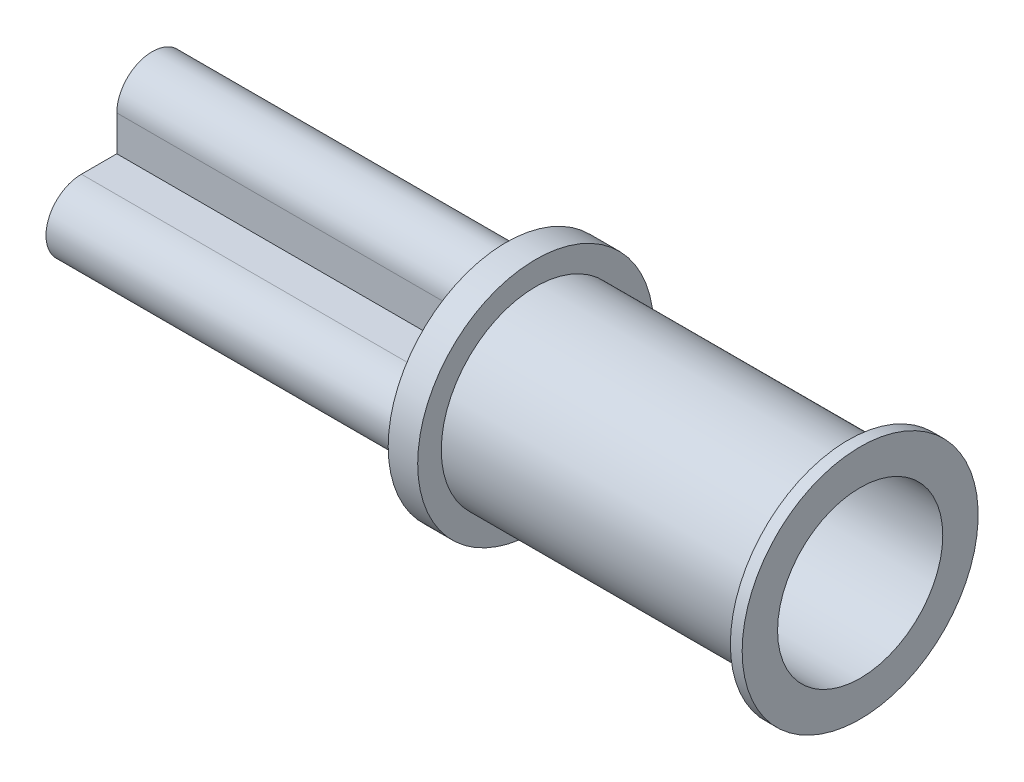
ISO-10303-21;
HEADER;
FILE_DESCRIPTION(('STEP AP214'),'2;1');
FILE_NAME('part.step','',(''),(''),'','','');
FILE_SCHEMA(('AUTOMOTIVE_DESIGN { 1 0 10303 214 1 1 1 1 }'));
ENDSEC;
DATA;
#1=APPLICATION_CONTEXT('core data for automotive mechanical design processes');
#2=APPLICATION_PROTOCOL_DEFINITION('international standard','automotive_design',2000,#1);
#3=PRODUCT_CONTEXT('',#1,'mechanical');
#4=PRODUCT('Part','Part','',(#3));
#5=PRODUCT_RELATED_PRODUCT_CATEGORY('part','',(#4));
#6=PRODUCT_DEFINITION_FORMATION('','',#4);
#7=PRODUCT_DEFINITION_CONTEXT('part definition',#1,'design');
#8=PRODUCT_DEFINITION('design','',#6,#7);
#9=PRODUCT_DEFINITION_SHAPE('','',#8);
#10=(LENGTH_UNIT() NAMED_UNIT(*) SI_UNIT(.MILLI.,.METRE.));
#11=(NAMED_UNIT(*) PLANE_ANGLE_UNIT() SI_UNIT($,.RADIAN.));
#12=(NAMED_UNIT(*) SI_UNIT($,.STERADIAN.) SOLID_ANGLE_UNIT());
#13=UNCERTAINTY_MEASURE_WITH_UNIT(LENGTH_MEASURE(1.E-05),#10,'distance_accuracy_value','');
#14=(GEOMETRIC_REPRESENTATION_CONTEXT(3) GLOBAL_UNCERTAINTY_ASSIGNED_CONTEXT((#13)) GLOBAL_UNIT_ASSIGNED_CONTEXT((#10,
#11,#12)) REPRESENTATION_CONTEXT('',''));
#15=CARTESIAN_POINT('',(0.,0.,0.));
#16=DIRECTION('',(0.,0.,1.));
#17=DIRECTION('',(1.,0.,0.));
#18=AXIS2_PLACEMENT_3D('',#15,#16,#17);
#19=CARTESIAN_POINT('',(0.635,0.,0.));
#20=DIRECTION('',(-1.,0.,0.));
#21=DIRECTION('',(0.,0.,1.));
#22=AXIS2_PLACEMENT_3D('',#19,#20,#21);
#23=PLANE('',#22);
#24=CARTESIAN_POINT('',(0.635,0.,0.));
#25=DIRECTION('',(-1.,0.,0.));
#26=DIRECTION('',(0.,0.,1.));
#27=AXIS2_PLACEMENT_3D('',#24,#25,#26);
#28=CIRCLE('',#27,1.778);
#29=CARTESIAN_POINT('',(0.635,0.,1.778));
#30=VERTEX_POINT('',#29);
#31=EDGE_CURVE('E11',#30,#30,#28,.T.);
#32=ORIENTED_EDGE('',*,*,#31,.F.);
#33=EDGE_LOOP('',(#32));
#34=FACE_BOUND('',#33,.T.);
#35=ADVANCED_FACE('F32',(#34),#23,.F.);
#36=CARTESIAN_POINT('',(0.,0.,0.));
#37=DIRECTION('',(-1.,0.,0.));
#38=DIRECTION('',(0.,0.,1.));
#39=AXIS2_PLACEMENT_3D('',#36,#37,#38);
#40=CYLINDRICAL_SURFACE('',#39,1.778);
#41=CARTESIAN_POINT('',(7.62,0.,0.));
#42=DIRECTION('',(-1.,0.,0.));
#43=DIRECTION('',(0.,0.,1.));
#44=AXIS2_PLACEMENT_3D('',#41,#42,#43);
#45=CIRCLE('',#44,1.778);
#46=CARTESIAN_POINT('',(7.62,0.,1.778));
#47=VERTEX_POINT('',#46);
#48=EDGE_CURVE('E39',#47,#47,#45,.T.);
#49=ORIENTED_EDGE('',*,*,#48,.F.);
#50=EDGE_LOOP('',(#49));
#51=FACE_BOUND('',#50,.T.);
#52=ORIENTED_EDGE('',*,*,#31,.T.);
#53=EDGE_LOOP('',(#52));
#54=FACE_BOUND('',#53,.T.);
#55=ADVANCED_FACE('F231',(#51,#54),#40,.F.);
#56=CARTESIAN_POINT('',(7.62,2.54,0.));
#57=DIRECTION('',(-1.,0.,0.));
#58=DIRECTION('',(0.,0.,1.));
#59=AXIS2_PLACEMENT_3D('',#56,#57,#58);
#60=PLANE('',#59);
#61=CARTESIAN_POINT('',(7.62,0.,0.));
#62=DIRECTION('',(-1.,0.,0.));
#63=DIRECTION('',(0.,0.,1.));
#64=AXIS2_PLACEMENT_3D('',#61,#62,#63);
#65=CIRCLE('',#64,2.54);
#66=CARTESIAN_POINT('',(7.62,0.,2.54));
#67=VERTEX_POINT('',#66);
#68=EDGE_CURVE('E224',#67,#67,#65,.T.);
#69=ORIENTED_EDGE('',*,*,#68,.F.);
#70=EDGE_LOOP('',(#69));
#71=FACE_BOUND('',#70,.T.);
#72=ORIENTED_EDGE('',*,*,#48,.T.);
#73=EDGE_LOOP('',(#72));
#74=FACE_BOUND('',#73,.T.);
#75=ADVANCED_FACE('F229',(#71,#74),#60,.F.);
#76=CARTESIAN_POINT('',(0.,0.,0.));
#77=DIRECTION('',(-1.,0.,0.));
#78=DIRECTION('',(0.,0.,1.));
#79=AXIS2_PLACEMENT_3D('',#76,#77,#78);
#80=CYLINDRICAL_SURFACE('',#79,2.54);
#81=CARTESIAN_POINT('',(7.366,0.,0.));
#82=DIRECTION('',(-1.,0.,0.));
#83=DIRECTION('',(0.,0.,1.));
#84=AXIS2_PLACEMENT_3D('',#81,#82,#83);
#85=CIRCLE('',#84,2.54);
#86=CARTESIAN_POINT('',(7.366,0.,2.54));
#87=VERTEX_POINT('',#86);
#88=EDGE_CURVE('E221',#87,#87,#85,.T.);
#89=ORIENTED_EDGE('',*,*,#88,.F.);
#90=EDGE_LOOP('',(#89));
#91=FACE_BOUND('',#90,.T.);
#92=ORIENTED_EDGE('',*,*,#68,.T.);
#93=EDGE_LOOP('',(#92));
#94=FACE_BOUND('',#93,.T.);
#95=ADVANCED_FACE('F249',(#91,#94),#80,.T.);
#96=CARTESIAN_POINT('',(7.366,2.032,0.));
#97=DIRECTION('',(1.,0.,0.));
#98=DIRECTION('',(0.,0.,-1.));
#99=AXIS2_PLACEMENT_3D('',#96,#97,#98);
#100=PLANE('',#99);
#101=CARTESIAN_POINT('',(7.366,0.,0.));
#102=DIRECTION('',(-1.,0.,0.));
#103=DIRECTION('',(0.,0.,1.));
#104=AXIS2_PLACEMENT_3D('',#101,#102,#103);
#105=CIRCLE('',#104,2.032);
#106=CARTESIAN_POINT('',(7.366,0.,2.032));
#107=VERTEX_POINT('',#106);
#108=EDGE_CURVE('E218',#107,#107,#105,.T.);
#109=ORIENTED_EDGE('',*,*,#108,.F.);
#110=EDGE_LOOP('',(#109));
#111=FACE_BOUND('',#110,.T.);
#112=ORIENTED_EDGE('',*,*,#88,.T.);
#113=EDGE_LOOP('',(#112));
#114=FACE_BOUND('',#113,.T.);
#115=ADVANCED_FACE('F257',(#111,#114),#100,.F.);
#116=CARTESIAN_POINT('',(0.,0.,0.));
#117=DIRECTION('',(-1.,0.,0.));
#118=DIRECTION('',(0.,0.,1.));
#119=AXIS2_PLACEMENT_3D('',#116,#117,#118);
#120=CYLINDRICAL_SURFACE('',#119,2.032);
#121=CARTESIAN_POINT('',(0.635,0.,0.));
#122=DIRECTION('',(-1.,0.,0.));
#123=DIRECTION('',(0.,0.,1.));
#124=AXIS2_PLACEMENT_3D('',#121,#122,#123);
#125=CIRCLE('',#124,2.032);
#126=CARTESIAN_POINT('',(0.635,0.,2.032));
#127=VERTEX_POINT('',#126);
#128=EDGE_CURVE('E215',#127,#127,#125,.T.);
#129=ORIENTED_EDGE('',*,*,#128,.F.);
#130=EDGE_LOOP('',(#129));
#131=FACE_BOUND('',#130,.T.);
#132=ORIENTED_EDGE('',*,*,#108,.T.);
#133=EDGE_LOOP('',(#132));
#134=FACE_BOUND('',#133,.T.);
#135=ADVANCED_FACE('F265',(#131,#134),#120,.T.);
#136=CARTESIAN_POINT('',(0.635,2.54,0.));
#137=DIRECTION('',(-1.,0.,0.));
#138=DIRECTION('',(0.,0.,1.));
#139=AXIS2_PLACEMENT_3D('',#136,#137,#138);
#140=PLANE('',#139);
#141=CARTESIAN_POINT('',(0.635,0.,0.));
#142=DIRECTION('',(-1.,0.,0.));
#143=DIRECTION('',(0.,0.,1.));
#144=AXIS2_PLACEMENT_3D('',#141,#142,#143);
#145=CIRCLE('',#144,2.54);
#146=CARTESIAN_POINT('',(0.635,0.,2.54));
#147=VERTEX_POINT('',#146);
#148=EDGE_CURVE('E212',#147,#147,#145,.T.);
#149=ORIENTED_EDGE('',*,*,#148,.F.);
#150=EDGE_LOOP('',(#149));
#151=FACE_BOUND('',#150,.T.);
#152=ORIENTED_EDGE('',*,*,#128,.T.);
#153=EDGE_LOOP('',(#152));
#154=FACE_BOUND('',#153,.T.);
#155=ADVANCED_FACE('F273',(#151,#154),#140,.F.);
#156=CARTESIAN_POINT('',(0.,0.,0.));
#157=DIRECTION('',(-1.,0.,0.));
#158=DIRECTION('',(0.,0.,1.));
#159=AXIS2_PLACEMENT_3D('',#156,#157,#158);
#160=CYLINDRICAL_SURFACE('',#159,2.54);
#161=CARTESIAN_POINT('',(0.,0.,0.));
#162=DIRECTION('',(-1.,0.,0.));
#163=DIRECTION('',(0.,0.,1.));
#164=AXIS2_PLACEMENT_3D('',#161,#162,#163);
#165=CIRCLE('',#164,2.54);
#166=CARTESIAN_POINT('',(0.,0.,2.54));
#167=VERTEX_POINT('',#166);
#168=EDGE_CURVE('E192',#167,#167,#165,.T.);
#169=ORIENTED_EDGE('',*,*,#168,.F.);
#170=EDGE_LOOP('',(#169));
#171=FACE_BOUND('',#170,.T.);
#172=ORIENTED_EDGE('',*,*,#148,.T.);
#173=EDGE_LOOP('',(#172));
#174=FACE_BOUND('',#173,.T.);
#175=ADVANCED_FACE('F281',(#171,#174),#160,.T.);
#176=CARTESIAN_POINT('',(0.,1.778,0.));
#177=DIRECTION('',(1.,0.,0.));
#178=DIRECTION('',(0.,0.,-1.));
#179=AXIS2_PLACEMENT_3D('',#176,#177,#178);
#180=PLANE('',#179);
#181=DIRECTION('',(0.,0.,1.));
#182=VECTOR('',#181,1.);
#183=CARTESIAN_POINT('',(0.,0.762000000000001,1.524));
#184=LINE('',#183,#182);
#185=CARTESIAN_POINT('',(0.,0.762000000000001,0.761999999999998));
#186=VERTEX_POINT('',#185);
#187=CARTESIAN_POINT('',(0.,0.762000000000001,1.524));
#188=VERTEX_POINT('',#187);
#189=EDGE_CURVE('E187',#186,#188,#184,.T.);
#190=ORIENTED_EDGE('',*,*,#189,.T.);
#191=CARTESIAN_POINT('',(0.,0.,1.524));
#192=DIRECTION('',(1.,0.,0.));
#193=DIRECTION('',(0.,0.,-1.));
#194=AXIS2_PLACEMENT_3D('',#191,#192,#193);
#195=CIRCLE('',#194,0.762);
#196=CARTESIAN_POINT('',(0.,-0.761999999999999,1.524));
#197=VERTEX_POINT('',#196);
#198=EDGE_CURVE('E159',#188,#197,#195,.T.);
#199=ORIENTED_EDGE('',*,*,#198,.T.);
#200=DIRECTION('',(0.,0.,-1.));
#201=VECTOR('',#200,1.);
#202=CARTESIAN_POINT('',(0.,-0.761999999999999,1.524));
#203=LINE('',#202,#201);
#204=CARTESIAN_POINT('',(0.,-0.761999999999998,0.761999999999998));
#205=VERTEX_POINT('',#204);
#206=EDGE_CURVE('E162',#197,#205,#203,.T.);
#207=ORIENTED_EDGE('',*,*,#206,.T.);
#208=DIRECTION('',(0.,-1.,0.));
#209=VECTOR('',#208,1.);
#210=CARTESIAN_POINT('',(0.,-0.761999999999998,0.761999999999998));
#211=LINE('',#210,#209);
#212=CARTESIAN_POINT('',(0.,-1.524,0.761999999999998));
#213=VERTEX_POINT('',#212);
#214=EDGE_CURVE('E46',#205,#213,#211,.T.);
#215=ORIENTED_EDGE('',*,*,#214,.T.);
#216=CARTESIAN_POINT('',(0.,-1.524,0.));
#217=DIRECTION('',(1.,0.,0.));
#218=DIRECTION('',(0.,0.,-1.));
#219=AXIS2_PLACEMENT_3D('',#216,#217,#218);
#220=CIRCLE('',#219,0.761999999999999);
#221=CARTESIAN_POINT('',(0.,-1.524,-0.761999999999999));
#222=VERTEX_POINT('',#221);
#223=EDGE_CURVE('E166',#213,#222,#220,.T.);
#224=ORIENTED_EDGE('',*,*,#223,.T.);
#225=DIRECTION('',(0.,1.,0.));
#226=VECTOR('',#225,1.);
#227=CARTESIAN_POINT('',(0.,-0.761999999999999,-0.761999999999999));
#228=LINE('',#227,#226);
#229=CARTESIAN_POINT('',(0.,-0.761999999999999,-0.761999999999999));
#230=VERTEX_POINT('',#229);
#231=EDGE_CURVE('E169',#222,#230,#228,.T.);
#232=ORIENTED_EDGE('',*,*,#231,.T.);
#233=DIRECTION('',(0.,0.,-1.));
#234=VECTOR('',#233,1.);
#235=CARTESIAN_POINT('',(0.,-0.761999999999999,-0.761999999999999));
#236=LINE('',#235,#234);
#237=CARTESIAN_POINT('',(0.,-0.762,-1.524));
#238=VERTEX_POINT('',#237);
#239=EDGE_CURVE('E172',#230,#238,#236,.T.);
#240=ORIENTED_EDGE('',*,*,#239,.T.);
#241=CARTESIAN_POINT('',(0.,0.,-1.524));
#242=DIRECTION('',(1.,0.,0.));
#243=DIRECTION('',(0.,0.,-1.));
#244=AXIS2_PLACEMENT_3D('',#241,#242,#243);
#245=CIRCLE('',#244,0.762);
#246=CARTESIAN_POINT('',(0.,0.762000000000001,-1.524));
#247=VERTEX_POINT('',#246);
#248=EDGE_CURVE('E175',#238,#247,#245,.T.);
#249=ORIENTED_EDGE('',*,*,#248,.T.);
#250=DIRECTION('',(0.,0.,1.));
#251=VECTOR('',#250,1.);
#252=CARTESIAN_POINT('',(0.,0.762000000000001,-0.761999999999999));
#253=LINE('',#252,#251);
#254=CARTESIAN_POINT('',(0.,0.762000000000001,-0.761999999999999));
#255=VERTEX_POINT('',#254);
#256=EDGE_CURVE('E178',#247,#255,#253,.T.);
#257=ORIENTED_EDGE('',*,*,#256,.T.);
#258=DIRECTION('',(0.,1.,0.));
#259=VECTOR('',#258,1.);
#260=CARTESIAN_POINT('',(0.,1.524,-0.761999999999999));
#261=LINE('',#260,#259);
#262=CARTESIAN_POINT('',(0.,1.524,-0.762));
#263=VERTEX_POINT('',#262);
#264=EDGE_CURVE('E181',#255,#263,#261,.T.);
#265=ORIENTED_EDGE('',*,*,#264,.T.);
#266=CARTESIAN_POINT('',(0.,1.524,0.));
#267=DIRECTION('',(1.,0.,0.));
#268=DIRECTION('',(0.,0.,-1.));
#269=AXIS2_PLACEMENT_3D('',#266,#267,#268);
#270=CIRCLE('',#269,0.761999999999999);
#271=CARTESIAN_POINT('',(0.,1.524,0.761999999999998));
#272=VERTEX_POINT('',#271);
#273=EDGE_CURVE('E184',#263,#272,#270,.T.);
#274=ORIENTED_EDGE('',*,*,#273,.T.);
#275=DIRECTION('',(0.,-1.,0.));
#276=VECTOR('',#275,1.);
#277=CARTESIAN_POINT('',(0.,1.524,0.761999999999998));
#278=LINE('',#277,#276);
#279=EDGE_CURVE('E135',#272,#186,#278,.T.);
#280=ORIENTED_EDGE('',*,*,#279,.T.);
#281=EDGE_LOOP('',(#190,#199,#207,#215,#224,#232,#240,#249,#257,#265,#274,#280));
#282=FACE_BOUND('',#281,.T.);
#283=ORIENTED_EDGE('',*,*,#168,.T.);
#284=EDGE_LOOP('',(#283));
#285=FACE_BOUND('',#284,.T.);
#286=ADVANCED_FACE('F289',(#282,#285),#180,.F.);
#287=CARTESIAN_POINT('',(-7.62,0.,1.524));
#288=DIRECTION('',(1.,0.,0.));
#289=DIRECTION('',(0.,0.,-1.));
#290=AXIS2_PLACEMENT_3D('',#287,#288,#289);
#291=CYLINDRICAL_SURFACE('',#290,0.762);
#292=ORIENTED_EDGE('',*,*,#198,.F.);
#293=DIRECTION('',(1.,0.,0.));
#294=VECTOR('',#293,1.);
#295=CARTESIAN_POINT('',(-7.62,0.762000000000001,1.524));
#296=LINE('',#295,#294);
#297=CARTESIAN_POINT('',(-7.62,0.762000000000001,1.524));
#298=VERTEX_POINT('',#297);
#299=EDGE_CURVE('E55',#298,#188,#296,.T.);
#300=ORIENTED_EDGE('',*,*,#299,.F.);
#301=CARTESIAN_POINT('',(-7.62,0.,1.524));
#302=DIRECTION('',(1.,0.,0.));
#303=DIRECTION('',(0.,0.,-1.));
#304=AXIS2_PLACEMENT_3D('',#301,#302,#303);
#305=CIRCLE('',#304,0.762);
#306=CARTESIAN_POINT('',(-7.62,-0.761999999999999,1.524));
#307=VERTEX_POINT('',#306);
#308=EDGE_CURVE('E190',#298,#307,#305,.T.);
#309=ORIENTED_EDGE('',*,*,#308,.T.);
#310=DIRECTION('',(1.,0.,0.));
#311=VECTOR('',#310,1.);
#312=CARTESIAN_POINT('',(-7.62,-0.761999999999999,1.524));
#313=LINE('',#312,#311);
#314=EDGE_CURVE('E101',#307,#197,#313,.T.);
#315=ORIENTED_EDGE('',*,*,#314,.T.);
#316=EDGE_LOOP('',(#292,#300,#309,#315));
#317=FACE_BOUND('',#316,.T.);
#318=ADVANCED_FACE('F297',(#317),#291,.T.);
#319=CARTESIAN_POINT('',(-7.62,0.762000000000001,1.524));
#320=DIRECTION('',(0.,1.,0.));
#321=DIRECTION('',(0.,0.,1.));
#322=AXIS2_PLACEMENT_3D('',#319,#320,#321);
#323=PLANE('',#322);
#324=ORIENTED_EDGE('',*,*,#189,.F.);
#325=DIRECTION('',(1.,0.,0.));
#326=VECTOR('',#325,1.);
#327=CARTESIAN_POINT('',(-7.62,0.762000000000001,0.761999999999998));
#328=LINE('',#327,#326);
#329=CARTESIAN_POINT('',(-7.62,0.762000000000001,0.761999999999998));
#330=VERTEX_POINT('',#329);
#331=EDGE_CURVE('E140',#330,#186,#328,.T.);
#332=ORIENTED_EDGE('',*,*,#331,.F.);
#333=DIRECTION('',(0.,0.,1.));
#334=VECTOR('',#333,1.);
#335=CARTESIAN_POINT('',(-7.62,0.762000000000001,1.524));
#336=LINE('',#335,#334);
#337=EDGE_CURVE('E149',#330,#298,#336,.T.);
#338=ORIENTED_EDGE('',*,*,#337,.T.);
#339=ORIENTED_EDGE('',*,*,#299,.T.);
#340=EDGE_LOOP('',(#324,#332,#338,#339));
#341=FACE_BOUND('',#340,.T.);
#342=ADVANCED_FACE('F305',(#341),#323,.T.);
#343=CARTESIAN_POINT('',(-7.62,1.524,0.761999999999998));
#344=DIRECTION('',(0.,0.,1.));
#345=DIRECTION('',(0.,-1.,0.));
#346=AXIS2_PLACEMENT_3D('',#343,#344,#345);
#347=PLANE('',#346);
#348=ORIENTED_EDGE('',*,*,#279,.F.);
#349=DIRECTION('',(1.,0.,0.));
#350=VECTOR('',#349,1.);
#351=CARTESIAN_POINT('',(-7.62,1.524,0.761999999999998));
#352=LINE('',#351,#350);
#353=CARTESIAN_POINT('',(-7.62,1.524,0.761999999999998));
#354=VERTEX_POINT('',#353);
#355=EDGE_CURVE('E129',#354,#272,#352,.T.);
#356=ORIENTED_EDGE('',*,*,#355,.F.);
#357=DIRECTION('',(0.,-1.,0.));
#358=VECTOR('',#357,1.);
#359=CARTESIAN_POINT('',(-7.62,1.524,0.761999999999998));
#360=LINE('',#359,#358);
#361=EDGE_CURVE('E132',#354,#330,#360,.T.);
#362=ORIENTED_EDGE('',*,*,#361,.T.);
#363=ORIENTED_EDGE('',*,*,#331,.T.);
#364=EDGE_LOOP('',(#348,#356,#362,#363));
#365=FACE_BOUND('',#364,.T.);
#366=ADVANCED_FACE('F131',(#365),#347,.T.);
#367=CARTESIAN_POINT('',(-7.62,1.524,0.));
#368=DIRECTION('',(1.,0.,0.));
#369=DIRECTION('',(0.,0.,-1.));
#370=AXIS2_PLACEMENT_3D('',#367,#368,#369);
#371=CYLINDRICAL_SURFACE('',#370,0.761999999999999);
#372=ORIENTED_EDGE('',*,*,#273,.F.);
#373=DIRECTION('',(1.,0.,0.));
#374=VECTOR('',#373,1.);
#375=CARTESIAN_POINT('',(-7.62,1.524,-0.762));
#376=LINE('',#375,#374);
#377=CARTESIAN_POINT('',(-7.62,1.524,-0.762));
#378=VERTEX_POINT('',#377);
#379=EDGE_CURVE('E141',#378,#263,#376,.T.);
#380=ORIENTED_EDGE('',*,*,#379,.F.);
#381=CARTESIAN_POINT('',(-7.62,1.524,0.));
#382=DIRECTION('',(1.,0.,0.));
#383=DIRECTION('',(0.,0.,-1.));
#384=AXIS2_PLACEMENT_3D('',#381,#382,#383);
#385=CIRCLE('',#384,0.761999999999999);
#386=EDGE_CURVE('E147',#378,#354,#385,.T.);
#387=ORIENTED_EDGE('',*,*,#386,.T.);
#388=ORIENTED_EDGE('',*,*,#355,.T.);
#389=EDGE_LOOP('',(#372,#380,#387,#388));
#390=FACE_BOUND('',#389,.T.);
#391=ADVANCED_FACE('F151',(#390),#371,.T.);
#392=CARTESIAN_POINT('',(-7.62,1.524,-0.761999999999999));
#393=DIRECTION('',(0.,0.,-1.));
#394=DIRECTION('',(0.,1.,0.));
#395=AXIS2_PLACEMENT_3D('',#392,#393,#394);
#396=PLANE('',#395);
#397=ORIENTED_EDGE('',*,*,#264,.F.);
#398=DIRECTION('',(1.,0.,0.));
#399=VECTOR('',#398,1.);
#400=CARTESIAN_POINT('',(-7.62,0.762000000000001,-0.761999999999999));
#401=LINE('',#400,#399);
#402=CARTESIAN_POINT('',(-7.62,0.762000000000001,-0.761999999999999));
#403=VERTEX_POINT('',#402);
#404=EDGE_CURVE('E195',#403,#255,#401,.T.);
#405=ORIENTED_EDGE('',*,*,#404,.F.);
#406=DIRECTION('',(0.,1.,0.));
#407=VECTOR('',#406,1.);
#408=CARTESIAN_POINT('',(-7.62,1.524,-0.761999999999999));
#409=LINE('',#408,#407);
#410=EDGE_CURVE('E152',#403,#378,#409,.T.);
#411=ORIENTED_EDGE('',*,*,#410,.T.);
#412=ORIENTED_EDGE('',*,*,#379,.T.);
#413=EDGE_LOOP('',(#397,#405,#411,#412));
#414=FACE_BOUND('',#413,.T.);
#415=ADVANCED_FACE('F324',(#414),#396,.T.);
#416=CARTESIAN_POINT('',(-7.62,0.762000000000001,-0.761999999999999));
#417=DIRECTION('',(0.,1.,0.));
#418=DIRECTION('',(0.,0.,1.));
#419=AXIS2_PLACEMENT_3D('',#416,#417,#418);
#420=PLANE('',#419);
#421=ORIENTED_EDGE('',*,*,#256,.F.);
#422=DIRECTION('',(1.,0.,0.));
#423=VECTOR('',#422,1.);
#424=CARTESIAN_POINT('',(-7.62,0.762000000000001,-1.524));
#425=LINE('',#424,#423);
#426=CARTESIAN_POINT('',(-7.62,0.762000000000001,-1.524));
#427=VERTEX_POINT('',#426);
#428=EDGE_CURVE('E197',#427,#247,#425,.T.);
#429=ORIENTED_EDGE('',*,*,#428,.F.);
#430=DIRECTION('',(0.,0.,1.));
#431=VECTOR('',#430,1.);
#432=CARTESIAN_POINT('',(-7.62,0.762000000000001,-0.761999999999999));
#433=LINE('',#432,#431);
#434=EDGE_CURVE('E154',#427,#403,#433,.T.);
#435=ORIENTED_EDGE('',*,*,#434,.T.);
#436=ORIENTED_EDGE('',*,*,#404,.T.);
#437=EDGE_LOOP('',(#421,#429,#435,#436));
#438=FACE_BOUND('',#437,.T.);
#439=ADVANCED_FACE('F331',(#438),#420,.T.);
#440=CARTESIAN_POINT('',(-7.62,0.,-1.524));
#441=DIRECTION('',(1.,0.,0.));
#442=DIRECTION('',(0.,0.,-1.));
#443=AXIS2_PLACEMENT_3D('',#440,#441,#442);
#444=CYLINDRICAL_SURFACE('',#443,0.762);
#445=ORIENTED_EDGE('',*,*,#248,.F.);
#446=DIRECTION('',(1.,0.,0.));
#447=VECTOR('',#446,1.);
#448=CARTESIAN_POINT('',(-7.62,-0.762,-1.524));
#449=LINE('',#448,#447);
#450=CARTESIAN_POINT('',(-7.62,-0.762,-1.524));
#451=VERTEX_POINT('',#450);
#452=EDGE_CURVE('E199',#451,#238,#449,.T.);
#453=ORIENTED_EDGE('',*,*,#452,.F.);
#454=CARTESIAN_POINT('',(-7.62,0.,-1.524));
#455=DIRECTION('',(1.,0.,0.));
#456=DIRECTION('',(0.,0.,-1.));
#457=AXIS2_PLACEMENT_3D('',#454,#455,#456);
#458=CIRCLE('',#457,0.762);
#459=EDGE_CURVE('E458',#451,#427,#458,.T.);
#460=ORIENTED_EDGE('',*,*,#459,.T.);
#461=ORIENTED_EDGE('',*,*,#428,.T.);
#462=EDGE_LOOP('',(#445,#453,#460,#461));
#463=FACE_BOUND('',#462,.T.);
#464=ADVANCED_FACE('F339',(#463),#444,.T.);
#465=CARTESIAN_POINT('',(-7.62,-0.761999999999999,-0.761999999999999));
#466=DIRECTION('',(0.,-1.,0.));
#467=DIRECTION('',(0.,0.,-1.));
#468=AXIS2_PLACEMENT_3D('',#465,#466,#467);
#469=PLANE('',#468);
#470=ORIENTED_EDGE('',*,*,#239,.F.);
#471=DIRECTION('',(1.,0.,0.));
#472=VECTOR('',#471,1.);
#473=CARTESIAN_POINT('',(-7.62,-0.761999999999999,-0.761999999999999));
#474=LINE('',#473,#472);
#475=CARTESIAN_POINT('',(-7.62,-0.761999999999999,-0.761999999999999));
#476=VERTEX_POINT('',#475);
#477=EDGE_CURVE('E201',#476,#230,#474,.T.);
#478=ORIENTED_EDGE('',*,*,#477,.F.);
#479=DIRECTION('',(0.,0.,-1.));
#480=VECTOR('',#479,1.);
#481=CARTESIAN_POINT('',(-7.62,-0.761999999999999,-0.761999999999999));
#482=LINE('',#481,#480);
#483=EDGE_CURVE('E455',#476,#451,#482,.T.);
#484=ORIENTED_EDGE('',*,*,#483,.T.);
#485=ORIENTED_EDGE('',*,*,#452,.T.);
#486=EDGE_LOOP('',(#470,#478,#484,#485));
#487=FACE_BOUND('',#486,.T.);
#488=ADVANCED_FACE('F347',(#487),#469,.T.);
#489=CARTESIAN_POINT('',(-7.62,-0.761999999999999,-0.761999999999999));
#490=DIRECTION('',(0.,0.,-1.));
#491=DIRECTION('',(-1.,0.,0.));
#492=AXIS2_PLACEMENT_3D('',#489,#490,#491);
#493=PLANE('',#492);
#494=ORIENTED_EDGE('',*,*,#231,.F.);
#495=DIRECTION('',(1.,0.,0.));
#496=VECTOR('',#495,1.);
#497=CARTESIAN_POINT('',(-7.62,-1.524,-0.761999999999999));
#498=LINE('',#497,#496);
#499=CARTESIAN_POINT('',(-7.62,-1.524,-0.761999999999999));
#500=VERTEX_POINT('',#499);
#501=EDGE_CURVE('E203',#500,#222,#498,.T.);
#502=ORIENTED_EDGE('',*,*,#501,.F.);
#503=DIRECTION('',(0.,1.,0.));
#504=VECTOR('',#503,1.);
#505=CARTESIAN_POINT('',(-7.62,-0.761999999999999,-0.761999999999999));
#506=LINE('',#505,#504);
#507=EDGE_CURVE('E452',#500,#476,#506,.T.);
#508=ORIENTED_EDGE('',*,*,#507,.T.);
#509=ORIENTED_EDGE('',*,*,#477,.T.);
#510=EDGE_LOOP('',(#494,#502,#508,#509));
#511=FACE_BOUND('',#510,.T.);
#512=ADVANCED_FACE('F355',(#511),#493,.T.);
#513=CARTESIAN_POINT('',(-7.62,-1.524,0.));
#514=DIRECTION('',(1.,0.,0.));
#515=DIRECTION('',(0.,0.,-1.));
#516=AXIS2_PLACEMENT_3D('',#513,#514,#515);
#517=CYLINDRICAL_SURFACE('',#516,0.761999999999999);
#518=ORIENTED_EDGE('',*,*,#223,.F.);
#519=DIRECTION('',(1.,0.,0.));
#520=VECTOR('',#519,1.);
#521=CARTESIAN_POINT('',(-7.62,-1.524,0.761999999999998));
#522=LINE('',#521,#520);
#523=CARTESIAN_POINT('',(-7.62,-1.524,0.761999999999998));
#524=VERTEX_POINT('',#523);
#525=EDGE_CURVE('E205',#524,#213,#522,.T.);
#526=ORIENTED_EDGE('',*,*,#525,.F.);
#527=CARTESIAN_POINT('',(-7.62,-1.524,0.));
#528=DIRECTION('',(1.,0.,0.));
#529=DIRECTION('',(0.,0.,-1.));
#530=AXIS2_PLACEMENT_3D('',#527,#528,#529);
#531=CIRCLE('',#530,0.761999999999999);
#532=EDGE_CURVE('E449',#524,#500,#531,.T.);
#533=ORIENTED_EDGE('',*,*,#532,.T.);
#534=ORIENTED_EDGE('',*,*,#501,.T.);
#535=EDGE_LOOP('',(#518,#526,#533,#534));
#536=FACE_BOUND('',#535,.T.);
#537=ADVANCED_FACE('F363',(#536),#517,.T.);
#538=CARTESIAN_POINT('',(-7.62,-0.761999999999998,0.761999999999998));
#539=DIRECTION('',(0.,0.,1.));
#540=DIRECTION('',(0.,-1.,0.));
#541=AXIS2_PLACEMENT_3D('',#538,#539,#540);
#542=PLANE('',#541);
#543=ORIENTED_EDGE('',*,*,#214,.F.);
#544=DIRECTION('',(1.,0.,0.));
#545=VECTOR('',#544,1.);
#546=CARTESIAN_POINT('',(-7.62,-0.761999999999998,0.761999999999998));
#547=LINE('',#546,#545);
#548=CARTESIAN_POINT('',(-7.62,-0.761999999999998,0.761999999999998));
#549=VERTEX_POINT('',#548);
#550=EDGE_CURVE('E207',#549,#205,#547,.T.);
#551=ORIENTED_EDGE('',*,*,#550,.F.);
#552=DIRECTION('',(0.,-1.,0.));
#553=VECTOR('',#552,1.);
#554=CARTESIAN_POINT('',(-7.62,-0.761999999999998,0.761999999999998));
#555=LINE('',#554,#553);
#556=EDGE_CURVE('E444',#549,#524,#555,.T.);
#557=ORIENTED_EDGE('',*,*,#556,.T.);
#558=ORIENTED_EDGE('',*,*,#525,.T.);
#559=EDGE_LOOP('',(#543,#551,#557,#558));
#560=FACE_BOUND('',#559,.T.);
#561=ADVANCED_FACE('F371',(#560),#542,.T.);
#562=CARTESIAN_POINT('',(-7.62,-0.761999999999999,1.524));
#563=DIRECTION('',(0.,-1.,0.));
#564=DIRECTION('',(0.,0.,-1.));
#565=AXIS2_PLACEMENT_3D('',#562,#563,#564);
#566=PLANE('',#565);
#567=ORIENTED_EDGE('',*,*,#206,.F.);
#568=ORIENTED_EDGE('',*,*,#314,.F.);
#569=DIRECTION('',(0.,0.,-1.));
#570=VECTOR('',#569,1.);
#571=CARTESIAN_POINT('',(-7.62,-0.761999999999999,1.524));
#572=LINE('',#571,#570);
#573=EDGE_CURVE('E442',#307,#549,#572,.T.);
#574=ORIENTED_EDGE('',*,*,#573,.T.);
#575=ORIENTED_EDGE('',*,*,#550,.T.);
#576=EDGE_LOOP('',(#567,#568,#574,#575));
#577=FACE_BOUND('',#576,.T.);
#578=ADVANCED_FACE('F379',(#577),#566,.T.);
#579=CARTESIAN_POINT('',(-7.62,0.,1.524));
#580=DIRECTION('',(1.,0.,0.));
#581=DIRECTION('',(0.,0.,-1.));
#582=AXIS2_PLACEMENT_3D('',#579,#580,#581);
#583=PLANE('',#582);
#584=ORIENTED_EDGE('',*,*,#308,.F.);
#585=ORIENTED_EDGE('',*,*,#337,.F.);
#586=ORIENTED_EDGE('',*,*,#361,.F.);
#587=ORIENTED_EDGE('',*,*,#386,.F.);
#588=ORIENTED_EDGE('',*,*,#410,.F.);
#589=ORIENTED_EDGE('',*,*,#434,.F.);
#590=ORIENTED_EDGE('',*,*,#459,.F.);
#591=ORIENTED_EDGE('',*,*,#483,.F.);
#592=ORIENTED_EDGE('',*,*,#507,.F.);
#593=ORIENTED_EDGE('',*,*,#532,.F.);
#594=ORIENTED_EDGE('',*,*,#556,.F.);
#595=ORIENTED_EDGE('',*,*,#573,.F.);
#596=EDGE_LOOP('',(#584,#585,#586,#587,#588,#589,#590,#591,#592,#593,#594,#595));
#597=FACE_BOUND('',#596,.T.);
#598=ADVANCED_FACE('F145',(#597),#583,.F.);
#599=CLOSED_SHELL('',(#35,#55,#75,#95,#115,#135,#155,#175,#286,#318,#342,#366,#391,#415,#439,
#464,#488,#512,#537,#561,#578,#598));
#600=MANIFOLD_SOLID_BREP('B2',#599);
#601=ADVANCED_BREP_SHAPE_REPRESENTATION('',(#18,#600),#14);
#602=SHAPE_DEFINITION_REPRESENTATION(#9,#601);
ENDSEC;
END-ISO-10303-21;
